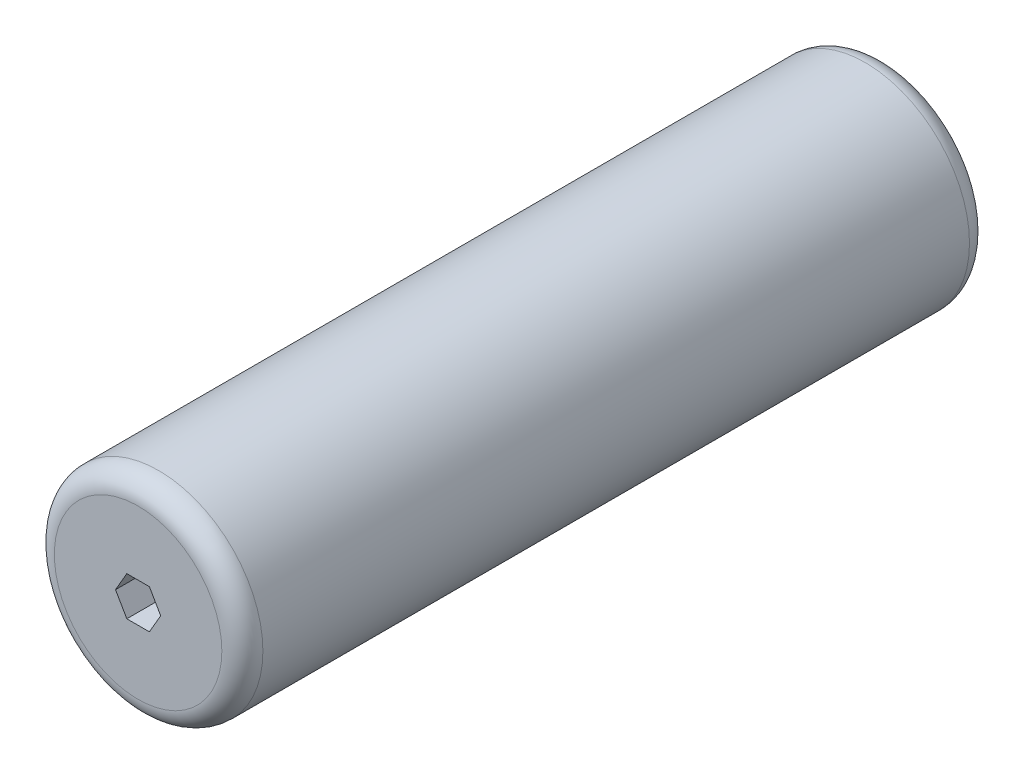
ISO-10303-21;
HEADER;
FILE_DESCRIPTION(('STEP AP214'),'2;1');
FILE_NAME('part.step','',(''),(''),'','','');
FILE_SCHEMA(('AUTOMOTIVE_DESIGN { 1 0 10303 214 1 1 1 1 }'));
ENDSEC;
DATA;
#1=APPLICATION_CONTEXT('core data for automotive mechanical design processes');
#2=APPLICATION_PROTOCOL_DEFINITION('international standard','automotive_design',2000,#1);
#3=PRODUCT_CONTEXT('',#1,'mechanical');
#4=PRODUCT('Part','Part','',(#3));
#5=PRODUCT_RELATED_PRODUCT_CATEGORY('part','',(#4));
#6=PRODUCT_DEFINITION_FORMATION('','',#4);
#7=PRODUCT_DEFINITION_CONTEXT('part definition',#1,'design');
#8=PRODUCT_DEFINITION('design','',#6,#7);
#9=PRODUCT_DEFINITION_SHAPE('','',#8);
#10=(LENGTH_UNIT() NAMED_UNIT(*) SI_UNIT(.MILLI.,.METRE.));
#11=(NAMED_UNIT(*) PLANE_ANGLE_UNIT() SI_UNIT($,.RADIAN.));
#12=(NAMED_UNIT(*) SI_UNIT($,.STERADIAN.) SOLID_ANGLE_UNIT());
#13=UNCERTAINTY_MEASURE_WITH_UNIT(LENGTH_MEASURE(1.E-05),#10,'distance_accuracy_value','');
#14=(GEOMETRIC_REPRESENTATION_CONTEXT(3) GLOBAL_UNCERTAINTY_ASSIGNED_CONTEXT((#13)) GLOBAL_UNIT_ASSIGNED_CONTEXT((#10,
#11,#12)) REPRESENTATION_CONTEXT('',''));
#15=CARTESIAN_POINT('',(0.,0.,0.));
#16=DIRECTION('',(0.,0.,1.));
#17=DIRECTION('',(1.,0.,0.));
#18=AXIS2_PLACEMENT_3D('',#15,#16,#17);
#19=CARTESIAN_POINT('',(0.,0.,182.118));
#20=DIRECTION('',(0.,0.,-1.));
#21=DIRECTION('',(-1.,0.,0.));
#22=AXIS2_PLACEMENT_3D('',#19,#20,#21);
#23=CYLINDRICAL_SURFACE('',#22,25.4);
#24=CARTESIAN_POINT('',(0.,0.,5.));
#25=DIRECTION('',(0.,0.,1.));
#26=DIRECTION('',(1.,0.,0.));
#27=AXIS2_PLACEMENT_3D('',#24,#25,#26);
#28=CIRCLE('',#27,25.4);
#29=CARTESIAN_POINT('',(25.4,0.,5.));
#30=VERTEX_POINT('',#29);
#31=EDGE_CURVE('E168',#30,#30,#28,.T.);
#32=ORIENTED_EDGE('',*,*,#31,.T.);
#33=EDGE_LOOP('',(#32));
#34=FACE_BOUND('',#33,.T.);
#35=CARTESIAN_POINT('',(0.,0.,177.118));
#36=DIRECTION('',(0.,0.,1.));
#37=DIRECTION('',(1.,0.,0.));
#38=AXIS2_PLACEMENT_3D('',#35,#36,#37);
#39=CIRCLE('',#38,25.4);
#40=CARTESIAN_POINT('',(25.4,0.,177.118));
#41=VERTEX_POINT('',#40);
#42=EDGE_CURVE('E153',#41,#41,#39,.F.);
#43=ORIENTED_EDGE('',*,*,#42,.T.);
#44=EDGE_LOOP('',(#43));
#45=FACE_BOUND('',#44,.T.);
#46=ADVANCED_FACE('F41',(#34,#45),#23,.T.);
#47=CARTESIAN_POINT('',(0.,0.,182.118));
#48=DIRECTION('',(0.,0.,1.));
#49=DIRECTION('',(1.,0.,0.));
#50=AXIS2_PLACEMENT_3D('',#47,#48,#49);
#51=PLANE('',#50);
#52=CARTESIAN_POINT('',(0.,0.,182.118));
#53=DIRECTION('',(0.,0.,1.));
#54=DIRECTION('',(1.,0.,0.));
#55=AXIS2_PLACEMENT_3D('',#52,#53,#54);
#56=CIRCLE('',#55,20.4);
#57=CARTESIAN_POINT('',(20.4,0.,182.118));
#58=VERTEX_POINT('',#57);
#59=EDGE_CURVE('E11',#58,#58,#56,.T.);
#60=ORIENTED_EDGE('',*,*,#59,.T.);
#61=EDGE_LOOP('',(#60));
#62=FACE_BOUND('',#61,.T.);
#63=DIRECTION('',(0.5,0.866025403784439,0.));
#64=VECTOR('',#63,1.);
#65=CARTESIAN_POINT('',(2.74963065701559,-4.7625,182.118));
#66=LINE('',#65,#64);
#67=CARTESIAN_POINT('',(2.74963065701559,-4.7625,182.118));
#68=VERTEX_POINT('',#67);
#69=CARTESIAN_POINT('',(5.49926131403119,0.,182.118));
#70=VERTEX_POINT('',#69);
#71=EDGE_CURVE('E57',#68,#70,#66,.T.);
#72=ORIENTED_EDGE('',*,*,#71,.F.);
#73=DIRECTION('',(1.,0.,0.));
#74=VECTOR('',#73,1.);
#75=CARTESIAN_POINT('',(-2.74963065701559,-4.7625,182.118));
#76=LINE('',#75,#74);
#77=CARTESIAN_POINT('',(-2.74963065701559,-4.7625,182.118));
#78=VERTEX_POINT('',#77);
#79=EDGE_CURVE('E116',#78,#68,#76,.T.);
#80=ORIENTED_EDGE('',*,*,#79,.F.);
#81=DIRECTION('',(0.5,-0.866025403784439,0.));
#82=VECTOR('',#81,1.);
#83=CARTESIAN_POINT('',(-5.49926131403119,0.,182.118));
#84=LINE('',#83,#82);
#85=CARTESIAN_POINT('',(-5.49926131403119,0.,182.118));
#86=VERTEX_POINT('',#85);
#87=EDGE_CURVE('E120',#86,#78,#84,.T.);
#88=ORIENTED_EDGE('',*,*,#87,.F.);
#89=DIRECTION('',(-0.5,-0.866025403784439,0.));
#90=VECTOR('',#89,1.);
#91=CARTESIAN_POINT('',(-2.7496306570156,4.76250000000001,182.118));
#92=LINE('',#91,#90);
#93=CARTESIAN_POINT('',(-2.7496306570156,4.76250000000001,182.118));
#94=VERTEX_POINT('',#93);
#95=EDGE_CURVE('E143',#94,#86,#92,.T.);
#96=ORIENTED_EDGE('',*,*,#95,.F.);
#97=DIRECTION('',(-1.,0.,0.));
#98=VECTOR('',#97,1.);
#99=CARTESIAN_POINT('',(2.74963065701559,4.76250000000001,182.118));
#100=LINE('',#99,#98);
#101=CARTESIAN_POINT('',(2.74963065701559,4.76250000000001,182.118));
#102=VERTEX_POINT('',#101);
#103=EDGE_CURVE('E139',#102,#94,#100,.T.);
#104=ORIENTED_EDGE('',*,*,#103,.F.);
#105=DIRECTION('',(-0.5,0.866025403784439,0.));
#106=VECTOR('',#105,1.);
#107=CARTESIAN_POINT('',(5.49926131403119,0.,182.118));
#108=LINE('',#107,#106);
#109=EDGE_CURVE('E136',#70,#102,#108,.T.);
#110=ORIENTED_EDGE('',*,*,#109,.F.);
#111=EDGE_LOOP('',(#72,#80,#88,#96,#104,#110));
#112=FACE_BOUND('',#111,.T.);
#113=ADVANCED_FACE('F183',(#62,#112),#51,.T.);
#114=CARTESIAN_POINT('',(0.,0.,0.));
#115=DIRECTION('',(0.,0.,1.));
#116=DIRECTION('',(1.,0.,0.));
#117=AXIS2_PLACEMENT_3D('',#114,#115,#116);
#118=PLANE('',#117);
#119=CARTESIAN_POINT('',(0.,0.,0.));
#120=DIRECTION('',(0.,0.,1.));
#121=DIRECTION('',(1.,0.,0.));
#122=AXIS2_PLACEMENT_3D('',#119,#120,#121);
#123=CIRCLE('',#122,20.4);
#124=CARTESIAN_POINT('',(20.4,0.,0.));
#125=VERTEX_POINT('',#124);
#126=EDGE_CURVE('E50',#125,#125,#123,.F.);
#127=ORIENTED_EDGE('',*,*,#126,.T.);
#128=EDGE_LOOP('',(#127));
#129=FACE_BOUND('',#128,.T.);
#130=DIRECTION('',(1.,0.,0.));
#131=VECTOR('',#130,1.);
#132=CARTESIAN_POINT('',(-2.74963065701559,-4.7625,0.));
#133=LINE('',#132,#131);
#134=CARTESIAN_POINT('',(-2.74963065701559,-4.7625,0.));
#135=VERTEX_POINT('',#134);
#136=CARTESIAN_POINT('',(2.74963065701559,-4.7625,0.));
#137=VERTEX_POINT('',#136);
#138=EDGE_CURVE('E104',#135,#137,#133,.T.);
#139=ORIENTED_EDGE('',*,*,#138,.T.);
#140=DIRECTION('',(0.5,0.866025403784439,0.));
#141=VECTOR('',#140,1.);
#142=CARTESIAN_POINT('',(2.74963065701559,-4.7625,0.));
#143=LINE('',#142,#141);
#144=CARTESIAN_POINT('',(5.49926131403119,0.,0.));
#145=VERTEX_POINT('',#144);
#146=EDGE_CURVE('E97',#137,#145,#143,.T.);
#147=ORIENTED_EDGE('',*,*,#146,.T.);
#148=DIRECTION('',(-0.5,0.866025403784439,0.));
#149=VECTOR('',#148,1.);
#150=CARTESIAN_POINT('',(5.49926131403119,0.,0.));
#151=LINE('',#150,#149);
#152=CARTESIAN_POINT('',(2.74963065701559,4.76250000000001,0.));
#153=VERTEX_POINT('',#152);
#154=EDGE_CURVE('E107',#145,#153,#151,.T.);
#155=ORIENTED_EDGE('',*,*,#154,.T.);
#156=DIRECTION('',(-1.,0.,0.));
#157=VECTOR('',#156,1.);
#158=CARTESIAN_POINT('',(2.74963065701559,4.76250000000001,0.));
#159=LINE('',#158,#157);
#160=CARTESIAN_POINT('',(-2.7496306570156,4.76250000000001,0.));
#161=VERTEX_POINT('',#160);
#162=EDGE_CURVE('E65',#153,#161,#159,.T.);
#163=ORIENTED_EDGE('',*,*,#162,.T.);
#164=DIRECTION('',(-0.5,-0.866025403784439,0.));
#165=VECTOR('',#164,1.);
#166=CARTESIAN_POINT('',(-2.7496306570156,4.76250000000001,0.));
#167=LINE('',#166,#165);
#168=CARTESIAN_POINT('',(-5.49926131403119,0.,0.));
#169=VERTEX_POINT('',#168);
#170=EDGE_CURVE('E125',#161,#169,#167,.T.);
#171=ORIENTED_EDGE('',*,*,#170,.T.);
#172=DIRECTION('',(0.5,-0.866025403784439,0.));
#173=VECTOR('',#172,1.);
#174=CARTESIAN_POINT('',(-5.49926131403119,0.,0.));
#175=LINE('',#174,#173);
#176=EDGE_CURVE('E129',#169,#135,#175,.T.);
#177=ORIENTED_EDGE('',*,*,#176,.T.);
#178=EDGE_LOOP('',(#139,#147,#155,#163,#171,#177));
#179=FACE_BOUND('',#178,.T.);
#180=ADVANCED_FACE('F112',(#129,#179),#118,.F.);
#181=CARTESIAN_POINT('',(2.74963065701559,-4.7625,0.));
#182=DIRECTION('',(0.866025403784439,-0.5,0.));
#183=DIRECTION('',(0.5,0.866025403784439,0.));
#184=AXIS2_PLACEMENT_3D('',#181,#182,#183);
#185=PLANE('',#184);
#186=ORIENTED_EDGE('',*,*,#71,.T.);
#187=DIRECTION('',(0.,0.,1.));
#188=VECTOR('',#187,1.);
#189=CARTESIAN_POINT('',(5.49926131403119,0.,0.));
#190=LINE('',#189,#188);
#191=EDGE_CURVE('E93',#145,#70,#190,.T.);
#192=ORIENTED_EDGE('',*,*,#191,.F.);
#193=ORIENTED_EDGE('',*,*,#146,.F.);
#194=DIRECTION('',(0.,0.,1.));
#195=VECTOR('',#194,1.);
#196=CARTESIAN_POINT('',(2.74963065701559,-4.7625,0.));
#197=LINE('',#196,#195);
#198=EDGE_CURVE('E150',#137,#68,#197,.T.);
#199=ORIENTED_EDGE('',*,*,#198,.T.);
#200=EDGE_LOOP('',(#186,#192,#193,#199));
#201=FACE_BOUND('',#200,.T.);
#202=ADVANCED_FACE('F95',(#201),#185,.F.);
#203=CARTESIAN_POINT('',(-2.74963065701559,-4.7625,0.));
#204=DIRECTION('',(0.,-1.,0.));
#205=DIRECTION('',(0.,0.,-1.));
#206=AXIS2_PLACEMENT_3D('',#203,#204,#205);
#207=PLANE('',#206);
#208=ORIENTED_EDGE('',*,*,#79,.T.);
#209=ORIENTED_EDGE('',*,*,#198,.F.);
#210=ORIENTED_EDGE('',*,*,#138,.F.);
#211=DIRECTION('',(0.,0.,1.));
#212=VECTOR('',#211,1.);
#213=CARTESIAN_POINT('',(-2.74963065701559,-4.7625,0.));
#214=LINE('',#213,#212);
#215=EDGE_CURVE('E154',#135,#78,#214,.T.);
#216=ORIENTED_EDGE('',*,*,#215,.T.);
#217=EDGE_LOOP('',(#208,#209,#210,#216));
#218=FACE_BOUND('',#217,.T.);
#219=ADVANCED_FACE('F206',(#218),#207,.F.);
#220=CARTESIAN_POINT('',(-5.49926131403119,0.,0.));
#221=DIRECTION('',(-0.866025403784439,-0.5,0.));
#222=DIRECTION('',(0.5,-0.866025403784439,0.));
#223=AXIS2_PLACEMENT_3D('',#220,#221,#222);
#224=PLANE('',#223);
#225=ORIENTED_EDGE('',*,*,#87,.T.);
#226=ORIENTED_EDGE('',*,*,#215,.F.);
#227=ORIENTED_EDGE('',*,*,#176,.F.);
#228=DIRECTION('',(0.,0.,1.));
#229=VECTOR('',#228,1.);
#230=CARTESIAN_POINT('',(-5.49926131403119,0.,0.));
#231=LINE('',#230,#229);
#232=EDGE_CURVE('E157',#169,#86,#231,.T.);
#233=ORIENTED_EDGE('',*,*,#232,.T.);
#234=EDGE_LOOP('',(#225,#226,#227,#233));
#235=FACE_BOUND('',#234,.T.);
#236=ADVANCED_FACE('F204',(#235),#224,.F.);
#237=CARTESIAN_POINT('',(-2.7496306570156,4.76250000000001,0.));
#238=DIRECTION('',(-0.866025403784439,0.5,0.));
#239=DIRECTION('',(-0.5,-0.866025403784439,0.));
#240=AXIS2_PLACEMENT_3D('',#237,#238,#239);
#241=PLANE('',#240);
#242=ORIENTED_EDGE('',*,*,#95,.T.);
#243=ORIENTED_EDGE('',*,*,#232,.F.);
#244=ORIENTED_EDGE('',*,*,#170,.F.);
#245=DIRECTION('',(0.,0.,1.));
#246=VECTOR('',#245,1.);
#247=CARTESIAN_POINT('',(-2.7496306570156,4.76250000000001,0.));
#248=LINE('',#247,#246);
#249=EDGE_CURVE('E160',#161,#94,#248,.T.);
#250=ORIENTED_EDGE('',*,*,#249,.T.);
#251=EDGE_LOOP('',(#242,#243,#244,#250));
#252=FACE_BOUND('',#251,.T.);
#253=ADVANCED_FACE('F201',(#252),#241,.F.);
#254=CARTESIAN_POINT('',(2.74963065701559,4.76250000000001,0.));
#255=DIRECTION('',(0.,1.,0.));
#256=DIRECTION('',(-1.,0.,0.));
#257=AXIS2_PLACEMENT_3D('',#254,#255,#256);
#258=PLANE('',#257);
#259=ORIENTED_EDGE('',*,*,#103,.T.);
#260=ORIENTED_EDGE('',*,*,#249,.F.);
#261=ORIENTED_EDGE('',*,*,#162,.F.);
#262=DIRECTION('',(0.,0.,1.));
#263=VECTOR('',#262,1.);
#264=CARTESIAN_POINT('',(2.74963065701559,4.76250000000001,0.));
#265=LINE('',#264,#263);
#266=EDGE_CURVE('E103',#153,#102,#265,.T.);
#267=ORIENTED_EDGE('',*,*,#266,.T.);
#268=EDGE_LOOP('',(#259,#260,#261,#267));
#269=FACE_BOUND('',#268,.T.);
#270=ADVANCED_FACE('F198',(#269),#258,.F.);
#271=CARTESIAN_POINT('',(5.49926131403119,0.,0.));
#272=DIRECTION('',(0.866025403784439,0.5,0.));
#273=DIRECTION('',(-0.5,0.866025403784439,0.));
#274=AXIS2_PLACEMENT_3D('',#271,#272,#273);
#275=PLANE('',#274);
#276=ORIENTED_EDGE('',*,*,#109,.T.);
#277=ORIENTED_EDGE('',*,*,#266,.F.);
#278=ORIENTED_EDGE('',*,*,#154,.F.);
#279=ORIENTED_EDGE('',*,*,#191,.T.);
#280=EDGE_LOOP('',(#276,#277,#278,#279));
#281=FACE_BOUND('',#280,.T.);
#282=ADVANCED_FACE('F108',(#281),#275,.F.);
#283=CARTESIAN_POINT('',(0.,0.,5.));
#284=DIRECTION('',(0.,0.,1.));
#285=DIRECTION('',(1.,0.,0.));
#286=AXIS2_PLACEMENT_3D('',#283,#284,#285);
#287=TOROIDAL_SURFACE('',#286,20.4,5.);
#288=ORIENTED_EDGE('',*,*,#126,.F.);
#289=EDGE_LOOP('',(#288));
#290=FACE_BOUND('',#289,.T.);
#291=ORIENTED_EDGE('',*,*,#31,.F.);
#292=EDGE_LOOP('',(#291));
#293=FACE_BOUND('',#292,.T.);
#294=ADVANCED_FACE('F176',(#290,#293),#287,.T.);
#295=CARTESIAN_POINT('',(0.,0.,177.118));
#296=DIRECTION('',(0.,0.,1.));
#297=DIRECTION('',(1.,0.,0.));
#298=AXIS2_PLACEMENT_3D('',#295,#296,#297);
#299=TOROIDAL_SURFACE('',#298,20.4,5.);
#300=ORIENTED_EDGE('',*,*,#42,.F.);
#301=EDGE_LOOP('',(#300));
#302=FACE_BOUND('',#301,.T.);
#303=ORIENTED_EDGE('',*,*,#59,.F.);
#304=EDGE_LOOP('',(#303));
#305=FACE_BOUND('',#304,.T.);
#306=ADVANCED_FACE('F43',(#302,#305),#299,.T.);
#307=CLOSED_SHELL('',(#46,#113,#180,#202,#219,#236,#253,#270,#282,#294,#306));
#308=MANIFOLD_SOLID_BREP('B2',#307);
#309=ADVANCED_BREP_SHAPE_REPRESENTATION('',(#18,#308),#14);
#310=SHAPE_DEFINITION_REPRESENTATION(#9,#309);
ENDSEC;
END-ISO-10303-21;
